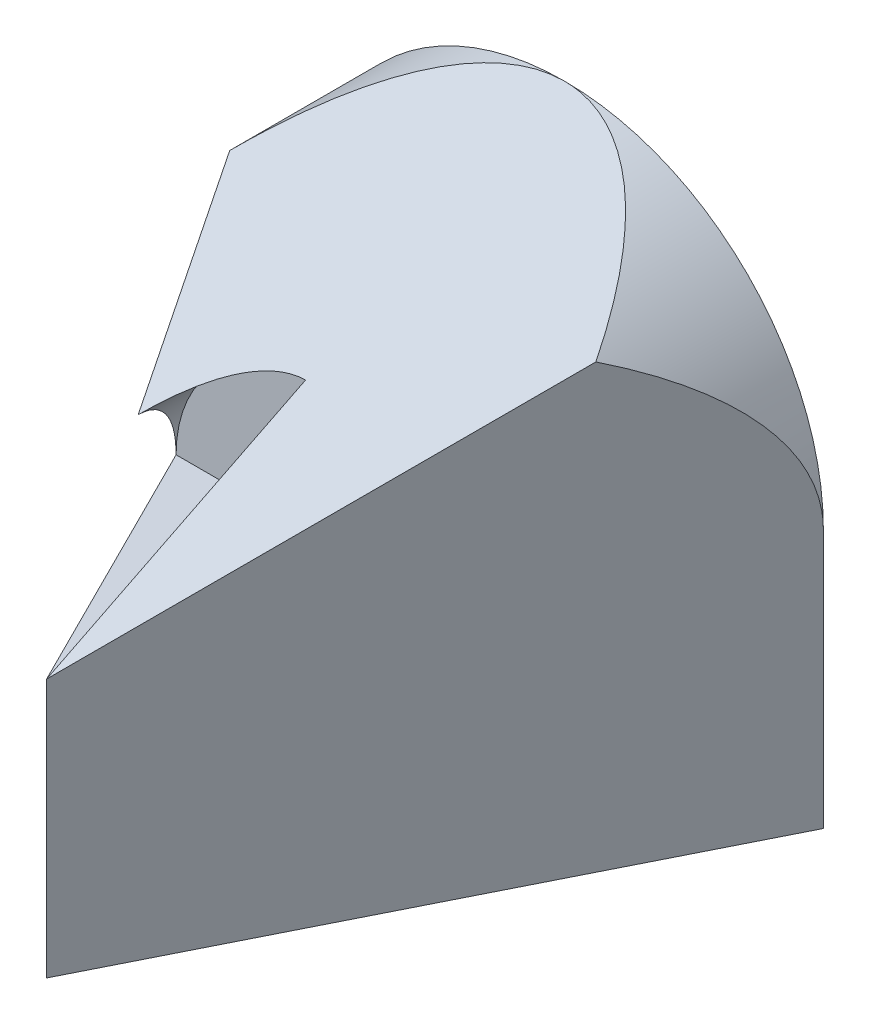
ISO-10303-21;
HEADER;
FILE_DESCRIPTION(('STEP AP214'),'2;1');
FILE_NAME('part.step','',(''),(''),'','','');
FILE_SCHEMA(('AUTOMOTIVE_DESIGN { 1 0 10303 214 1 1 1 1 }'));
ENDSEC;
DATA;
#1=APPLICATION_CONTEXT('core data for automotive mechanical design processes');
#2=APPLICATION_PROTOCOL_DEFINITION('international standard','automotive_design',2000,#1);
#3=PRODUCT_CONTEXT('',#1,'mechanical');
#4=PRODUCT('Part','Part','',(#3));
#5=PRODUCT_RELATED_PRODUCT_CATEGORY('part','',(#4));
#6=PRODUCT_DEFINITION_FORMATION('','',#4);
#7=PRODUCT_DEFINITION_CONTEXT('part definition',#1,'design');
#8=PRODUCT_DEFINITION('design','',#6,#7);
#9=PRODUCT_DEFINITION_SHAPE('','',#8);
#10=(LENGTH_UNIT() NAMED_UNIT(*) SI_UNIT(.MILLI.,.METRE.));
#11=(NAMED_UNIT(*) PLANE_ANGLE_UNIT() SI_UNIT($,.RADIAN.));
#12=(NAMED_UNIT(*) SI_UNIT($,.STERADIAN.) SOLID_ANGLE_UNIT());
#13=UNCERTAINTY_MEASURE_WITH_UNIT(LENGTH_MEASURE(1.E-05),#10,'distance_accuracy_value','');
#14=(GEOMETRIC_REPRESENTATION_CONTEXT(3) GLOBAL_UNCERTAINTY_ASSIGNED_CONTEXT((#13)) GLOBAL_UNIT_ASSIGNED_CONTEXT((#10,
#11,#12)) REPRESENTATION_CONTEXT('',''));
#15=CARTESIAN_POINT('',(0.,0.,0.));
#16=DIRECTION('',(0.,0.,1.));
#17=DIRECTION('',(1.,0.,0.));
#18=AXIS2_PLACEMENT_3D('',#15,#16,#17);
#19=CARTESIAN_POINT('',(20.,20.,40.));
#20=DIRECTION('',(0.,0.,-1.));
#21=DIRECTION('',(-1.,0.,0.));
#22=AXIS2_PLACEMENT_3D('',#19,#20,#21);
#23=CYLINDRICAL_SURFACE('',#22,20.);
#24=CARTESIAN_POINT('',(20.,20.,40.));
#25=DIRECTION('',(0.,0.894427190999916,0.447213595499958));
#26=DIRECTION('',(0.,0.447213595499958,-0.894427190999916));
#27=AXIS2_PLACEMENT_3D('',#24,#25,#26);
#28=ELLIPSE('',#27,44.7213595499958,20.);
#29=CARTESIAN_POINT('',(20.,40.,0.));
#30=VERTEX_POINT('',#29);
#31=CARTESIAN_POINT('',(5.85786437626904,34.1421356237309,11.7157287525381));
#32=VERTEX_POINT('',#31);
#33=EDGE_CURVE('E114',#30,#32,#28,.T.);
#34=ORIENTED_EDGE('',*,*,#33,.F.);
#35=CARTESIAN_POINT('',(20.,20.,0.));
#36=DIRECTION('',(0.,0.,1.));
#37=DIRECTION('',(1.,0.,0.));
#38=AXIS2_PLACEMENT_3D('',#35,#36,#37);
#39=CIRCLE('',#38,20.);
#40=CARTESIAN_POINT('',(0.,20.,0.));
#41=VERTEX_POINT('',#40);
#42=EDGE_CURVE('E125',#30,#41,#39,.T.);
#43=ORIENTED_EDGE('',*,*,#42,.T.);
#44=CARTESIAN_POINT('',(20.,20.,40.));
#45=DIRECTION('',(0.894427190999916,0.,-0.447213595499958));
#46=DIRECTION('',(-0.447213595499958,0.,-0.894427190999916));
#47=AXIS2_PLACEMENT_3D('',#44,#45,#46);
#48=ELLIPSE('',#47,44.7213595499958,20.);
#49=EDGE_CURVE('E127',#41,#32,#48,.T.);
#50=ORIENTED_EDGE('',*,*,#49,.T.);
#51=EDGE_LOOP('',(#34,#43,#50));
#52=FACE_BOUND('',#51,.T.);
#53=ADVANCED_FACE('F54',(#52),#23,.T.);
#54=CARTESIAN_POINT('',(34.142135623731,34.142135623731,11.7157287525381));
#55=VERTEX_POINT('',#54);
#56=EDGE_CURVE('E111',#55,#30,#28,.T.);
#57=ORIENTED_EDGE('',*,*,#56,.F.);
#58=CARTESIAN_POINT('',(20.,20.,40.));
#59=DIRECTION('',(-0.894427190999916,0.,-0.447213595499958));
#60=DIRECTION('',(0.447213595499958,0.,-0.894427190999916));
#61=AXIS2_PLACEMENT_3D('',#58,#59,#60);
#62=ELLIPSE('',#61,44.7213595499958,20.);
#63=CARTESIAN_POINT('',(40.,20.,0.));
#64=VERTEX_POINT('',#63);
#65=EDGE_CURVE('E139',#55,#64,#62,.T.);
#66=ORIENTED_EDGE('',*,*,#65,.T.);
#67=EDGE_CURVE('E134',#64,#30,#39,.T.);
#68=ORIENTED_EDGE('',*,*,#67,.T.);
#69=EDGE_LOOP('',(#57,#66,#68));
#70=FACE_BOUND('',#69,.T.);
#71=ADVANCED_FACE('F138',(#70),#23,.T.);
#72=CARTESIAN_POINT('',(20.,20.,20.));
#73=DIRECTION('',(0.,0.,1.));
#74=DIRECTION('',(1.,0.,0.));
#75=AXIS2_PLACEMENT_3D('',#72,#73,#74);
#76=CYLINDRICAL_SURFACE('',#75,10.);
#77=CARTESIAN_POINT('',(20.,20.,40.));
#78=DIRECTION('',(0.,0.894427190999916,0.447213595499958));
#79=DIRECTION('',(0.,-0.447213595499958,0.894427190999916));
#80=AXIS2_PLACEMENT_3D('',#77,#78,#79);
#81=ELLIPSE('',#80,22.3606797749979,10.);
#82=CARTESIAN_POINT('',(12.9289321881345,27.0710678118655,25.8578643762691));
#83=VERTEX_POINT('',#82);
#84=CARTESIAN_POINT('',(20.,30.,20.));
#85=VERTEX_POINT('',#84);
#86=EDGE_CURVE('E120',#83,#85,#81,.F.);
#87=ORIENTED_EDGE('',*,*,#86,.F.);
#88=CARTESIAN_POINT('',(20.,20.,40.));
#89=DIRECTION('',(0.894427190999916,0.,-0.447213595499958));
#90=DIRECTION('',(0.447213595499958,0.,0.894427190999916));
#91=AXIS2_PLACEMENT_3D('',#88,#89,#90);
#92=ELLIPSE('',#91,22.3606797749979,10.);
#93=CARTESIAN_POINT('',(10.,20.,20.));
#94=VERTEX_POINT('',#93);
#95=EDGE_CURVE('E68',#83,#94,#92,.F.);
#96=ORIENTED_EDGE('',*,*,#95,.T.);
#97=CARTESIAN_POINT('',(20.,20.,20.));
#98=DIRECTION('',(0.,0.,1.));
#99=DIRECTION('',(1.,0.,0.));
#100=AXIS2_PLACEMENT_3D('',#97,#98,#99);
#101=CIRCLE('',#100,10.);
#102=EDGE_CURVE('E173',#85,#94,#101,.T.);
#103=ORIENTED_EDGE('',*,*,#102,.F.);
#104=EDGE_LOOP('',(#87,#96,#103));
#105=FACE_BOUND('',#104,.T.);
#106=ADVANCED_FACE('F186',(#105),#76,.F.);
#107=CARTESIAN_POINT('',(20.,30.,20.));
#108=DIRECTION('',(1.,0.,0.));
#109=DIRECTION('',(0.,0.,-1.));
#110=AXIS2_PLACEMENT_3D('',#107,#108,#109);
#111=PLANE('',#110);
#112=DIRECTION('',(0.,-0.447213595499958,0.894427190999916));
#113=VECTOR('',#112,1.);
#114=CARTESIAN_POINT('',(20.,30.,20.));
#115=LINE('',#114,#113);
#116=CARTESIAN_POINT('',(20.,20.,40.));
#117=VERTEX_POINT('',#116);
#118=EDGE_CURVE('E179',#85,#117,#115,.T.);
#119=ORIENTED_EDGE('',*,*,#118,.F.);
#120=DIRECTION('',(0.,1.,0.));
#121=VECTOR('',#120,1.);
#122=CARTESIAN_POINT('',(20.,30.,20.));
#123=LINE('',#122,#121);
#124=CARTESIAN_POINT('',(20.,20.,20.));
#125=VERTEX_POINT('',#124);
#126=EDGE_CURVE('E171',#125,#85,#123,.T.);
#127=ORIENTED_EDGE('',*,*,#126,.F.);
#128=DIRECTION('',(0.,0.,1.));
#129=VECTOR('',#128,1.);
#130=CARTESIAN_POINT('',(20.,20.,20.));
#131=LINE('',#130,#129);
#132=EDGE_CURVE('E76',#125,#117,#131,.T.);
#133=ORIENTED_EDGE('',*,*,#132,.T.);
#134=EDGE_LOOP('',(#119,#127,#133));
#135=FACE_BOUND('',#134,.T.);
#136=ADVANCED_FACE('F178',(#135),#111,.F.);
#137=CARTESIAN_POINT('',(0.,59.,0.));
#138=DIRECTION('',(0.894427190999916,0.,-0.447213595499958));
#139=DIRECTION('',(-0.447213595499958,0.,-0.894427190999916));
#140=AXIS2_PLACEMENT_3D('',#137,#138,#139);
#141=PLANE('',#140);
#142=DIRECTION('',(0.408248290463863,-0.408248290463863,0.816496580927726));
#143=VECTOR('',#142,1.);
#144=CARTESIAN_POINT('',(-3.16666666666667,43.1666666666667,-6.33333333333334));
#145=LINE('',#144,#143);
#146=EDGE_CURVE('E128',#32,#83,#145,.T.);
#147=ORIENTED_EDGE('',*,*,#146,.F.);
#148=ORIENTED_EDGE('',*,*,#49,.F.);
#149=DIRECTION('',(0.,1.,0.));
#150=VECTOR('',#149,1.);
#151=CARTESIAN_POINT('',(0.,0.,0.));
#152=LINE('',#151,#150);
#153=CARTESIAN_POINT('',(0.,0.,0.));
#154=VERTEX_POINT('',#153);
#155=EDGE_CURVE('E136',#154,#41,#152,.T.);
#156=ORIENTED_EDGE('',*,*,#155,.F.);
#157=DIRECTION('',(0.447213595499958,0.,0.894427190999916));
#158=VECTOR('',#157,1.);
#159=CARTESIAN_POINT('',(0.,0.,0.));
#160=LINE('',#159,#158);
#161=CARTESIAN_POINT('',(20.,0.,40.));
#162=VERTEX_POINT('',#161);
#163=EDGE_CURVE('E155',#154,#162,#160,.T.);
#164=ORIENTED_EDGE('',*,*,#163,.T.);
#165=DIRECTION('',(0.,-1.,0.));
#166=VECTOR('',#165,1.);
#167=CARTESIAN_POINT('',(20.,59.,40.));
#168=LINE('',#167,#166);
#169=EDGE_CURVE('E158',#117,#162,#168,.T.);
#170=ORIENTED_EDGE('',*,*,#169,.F.);
#171=DIRECTION('',(0.447213595499958,0.,0.894427190999916));
#172=VECTOR('',#171,1.);
#173=CARTESIAN_POINT('',(12.,20.,24.));
#174=LINE('',#173,#172);
#175=EDGE_CURVE('E165',#94,#117,#174,.T.);
#176=ORIENTED_EDGE('',*,*,#175,.F.);
#177=ORIENTED_EDGE('',*,*,#95,.F.);
#178=EDGE_LOOP('',(#147,#148,#156,#164,#170,#176,#177));
#179=FACE_BOUND('',#178,.T.);
#180=ADVANCED_FACE('F182',(#179),#141,.F.);
#181=CARTESIAN_POINT('',(32.,59.,16.));
#182=DIRECTION('',(-0.894427190999916,0.,-0.447213595499958));
#183=DIRECTION('',(-0.447213595499958,0.,0.894427190999916));
#184=AXIS2_PLACEMENT_3D('',#181,#182,#183);
#185=PLANE('',#184);
#186=DIRECTION('',(0.408248290463863,0.408248290463863,-0.816496580927726));
#187=VECTOR('',#186,1.);
#188=CARTESIAN_POINT('',(36.5,36.5,6.99999999999999));
#189=LINE('',#188,#187);
#190=EDGE_CURVE('E12',#117,#55,#189,.T.);
#191=ORIENTED_EDGE('',*,*,#190,.F.);
#192=ORIENTED_EDGE('',*,*,#169,.T.);
#193=DIRECTION('',(0.447213595499958,0.,-0.894427190999916));
#194=VECTOR('',#193,1.);
#195=CARTESIAN_POINT('',(32.,0.,16.));
#196=LINE('',#195,#194);
#197=CARTESIAN_POINT('',(40.,0.,0.));
#198=VERTEX_POINT('',#197);
#199=EDGE_CURVE('E150',#162,#198,#196,.T.);
#200=ORIENTED_EDGE('',*,*,#199,.T.);
#201=DIRECTION('',(0.,1.,0.));
#202=VECTOR('',#201,1.);
#203=CARTESIAN_POINT('',(40.,0.,0.));
#204=LINE('',#203,#202);
#205=EDGE_CURVE('E61',#198,#64,#204,.T.);
#206=ORIENTED_EDGE('',*,*,#205,.T.);
#207=ORIENTED_EDGE('',*,*,#65,.F.);
#208=EDGE_LOOP('',(#191,#192,#200,#206,#207));
#209=FACE_BOUND('',#208,.T.);
#210=ADVANCED_FACE('F148',(#209),#185,.F.);
#211=CARTESIAN_POINT('',(0.,0.,40.));
#212=DIRECTION('',(0.,1.,0.));
#213=DIRECTION('',(0.,0.,1.));
#214=AXIS2_PLACEMENT_3D('',#211,#212,#213);
#215=PLANE('',#214);
#216=DIRECTION('',(1.,0.,0.));
#217=VECTOR('',#216,1.);
#218=CARTESIAN_POINT('',(0.,0.,0.));
#219=LINE('',#218,#217);
#220=EDGE_CURVE('E141',#154,#198,#219,.T.);
#221=ORIENTED_EDGE('',*,*,#220,.T.);
#222=ORIENTED_EDGE('',*,*,#199,.F.);
#223=ORIENTED_EDGE('',*,*,#163,.F.);
#224=EDGE_LOOP('',(#221,#222,#223));
#225=FACE_BOUND('',#224,.T.);
#226=ADVANCED_FACE('F153',(#225),#215,.F.);
#227=CARTESIAN_POINT('',(0.,0.,0.));
#228=DIRECTION('',(0.,0.,1.));
#229=DIRECTION('',(1.,0.,0.));
#230=AXIS2_PLACEMENT_3D('',#227,#228,#229);
#231=PLANE('',#230);
#232=ORIENTED_EDGE('',*,*,#67,.F.);
#233=ORIENTED_EDGE('',*,*,#205,.F.);
#234=ORIENTED_EDGE('',*,*,#220,.F.);
#235=ORIENTED_EDGE('',*,*,#155,.T.);
#236=ORIENTED_EDGE('',*,*,#42,.F.);
#237=EDGE_LOOP('',(#232,#233,#234,#235,#236));
#238=FACE_BOUND('',#237,.T.);
#239=ADVANCED_FACE('F132',(#238),#231,.F.);
#240=CARTESIAN_POINT('',(20.,20.,20.));
#241=DIRECTION('',(0.,-1.,0.));
#242=DIRECTION('',(0.,0.,-1.));
#243=AXIS2_PLACEMENT_3D('',#240,#241,#242);
#244=PLANE('',#243);
#245=DIRECTION('',(1.,0.,0.));
#246=VECTOR('',#245,1.);
#247=CARTESIAN_POINT('',(20.,20.,20.));
#248=LINE('',#247,#246);
#249=EDGE_CURVE('E168',#94,#125,#248,.T.);
#250=ORIENTED_EDGE('',*,*,#249,.F.);
#251=ORIENTED_EDGE('',*,*,#175,.T.);
#252=ORIENTED_EDGE('',*,*,#132,.F.);
#253=EDGE_LOOP('',(#250,#251,#252));
#254=FACE_BOUND('',#253,.T.);
#255=ADVANCED_FACE('F181',(#254),#244,.F.);
#256=CARTESIAN_POINT('',(20.,20.,20.));
#257=DIRECTION('',(0.,0.,1.));
#258=DIRECTION('',(1.,0.,0.));
#259=AXIS2_PLACEMENT_3D('',#256,#257,#258);
#260=PLANE('',#259);
#261=ORIENTED_EDGE('',*,*,#249,.T.);
#262=ORIENTED_EDGE('',*,*,#126,.T.);
#263=ORIENTED_EDGE('',*,*,#102,.T.);
#264=EDGE_LOOP('',(#261,#262,#263));
#265=FACE_BOUND('',#264,.T.);
#266=ADVANCED_FACE('F180',(#265),#260,.T.);
#267=CARTESIAN_POINT('',(59.,20.,40.));
#268=DIRECTION('',(0.,0.894427190999916,0.447213595499958));
#269=DIRECTION('',(0.,-0.447213595499958,0.894427190999916));
#270=AXIS2_PLACEMENT_3D('',#267,#268,#269);
#271=PLANE('',#270);
#272=ORIENTED_EDGE('',*,*,#146,.T.);
#273=ORIENTED_EDGE('',*,*,#86,.T.);
#274=ORIENTED_EDGE('',*,*,#118,.T.);
#275=ORIENTED_EDGE('',*,*,#190,.T.);
#276=ORIENTED_EDGE('',*,*,#56,.T.);
#277=ORIENTED_EDGE('',*,*,#33,.T.);
#278=EDGE_LOOP('',(#272,#273,#274,#275,#276,#277));
#279=FACE_BOUND('',#278,.T.);
#280=ADVANCED_FACE('F113',(#279),#271,.T.);
#281=CLOSED_SHELL('',(#53,#71,#106,#136,#180,#210,#226,#239,#255,#266,#280));
#282=MANIFOLD_SOLID_BREP('B2',#281);
#283=ADVANCED_BREP_SHAPE_REPRESENTATION('',(#18,#282),#14);
#284=SHAPE_DEFINITION_REPRESENTATION(#9,#283);
ENDSEC;
END-ISO-10303-21;
